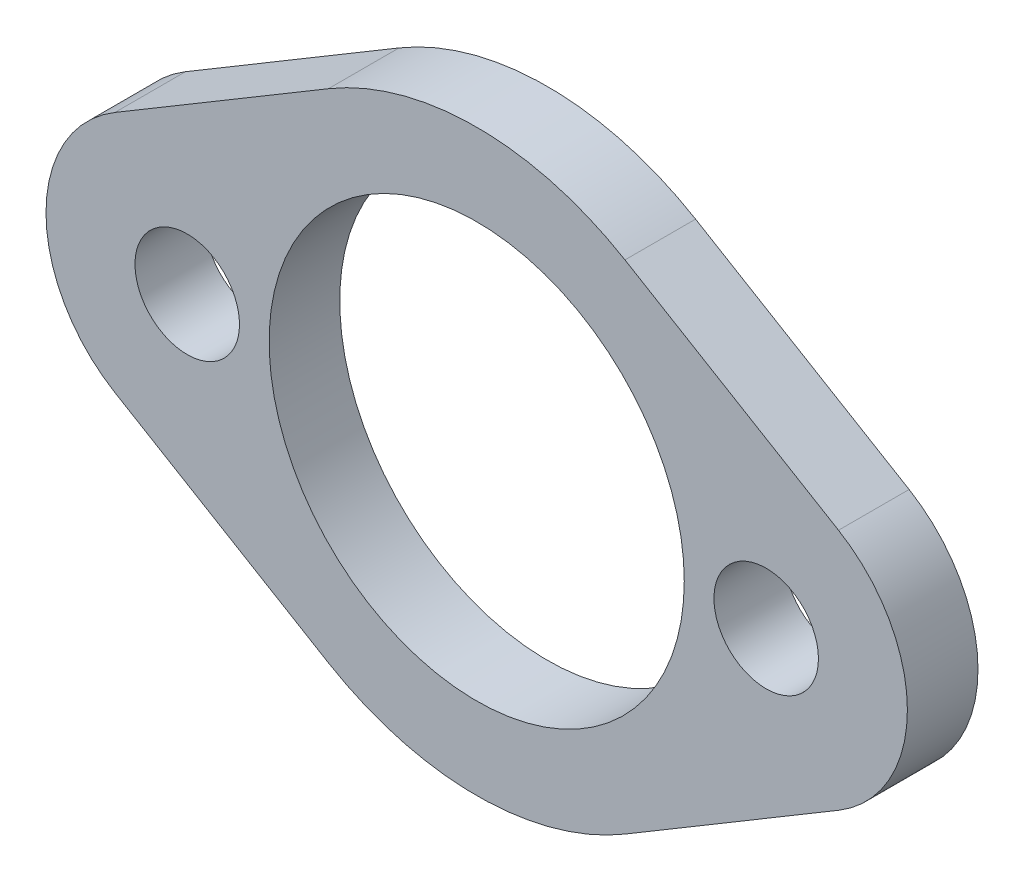
ISO-10303-21;
HEADER;
FILE_DESCRIPTION(('STEP AP214'),'2;1');
FILE_NAME('part.step','',(''),(''),'','','');
FILE_SCHEMA(('AUTOMOTIVE_DESIGN { 1 0 10303 214 1 1 1 1 }'));
ENDSEC;
DATA;
#1=APPLICATION_CONTEXT('core data for automotive mechanical design processes');
#2=APPLICATION_PROTOCOL_DEFINITION('international standard','automotive_design',2000,#1);
#3=PRODUCT_CONTEXT('',#1,'mechanical');
#4=PRODUCT('Part','Part','',(#3));
#5=PRODUCT_RELATED_PRODUCT_CATEGORY('part','',(#4));
#6=PRODUCT_DEFINITION_FORMATION('','',#4);
#7=PRODUCT_DEFINITION_CONTEXT('part definition',#1,'design');
#8=PRODUCT_DEFINITION('design','',#6,#7);
#9=PRODUCT_DEFINITION_SHAPE('','',#8);
#10=(LENGTH_UNIT() NAMED_UNIT(*) SI_UNIT(.MILLI.,.METRE.));
#11=(NAMED_UNIT(*) PLANE_ANGLE_UNIT() SI_UNIT($,.RADIAN.));
#12=(NAMED_UNIT(*) SI_UNIT($,.STERADIAN.) SOLID_ANGLE_UNIT());
#13=UNCERTAINTY_MEASURE_WITH_UNIT(LENGTH_MEASURE(1.E-05),#10,'distance_accuracy_value','');
#14=(GEOMETRIC_REPRESENTATION_CONTEXT(3) GLOBAL_UNCERTAINTY_ASSIGNED_CONTEXT((#13)) GLOBAL_UNIT_ASSIGNED_CONTEXT((#10,
#11,#12)) REPRESENTATION_CONTEXT('',''));
#15=CARTESIAN_POINT('',(0.,0.,0.));
#16=DIRECTION('',(0.,0.,1.));
#17=DIRECTION('',(1.,0.,0.));
#18=AXIS2_PLACEMENT_3D('',#15,#16,#17);
#19=CARTESIAN_POINT('',(0.,0.,6.35));
#20=DIRECTION('',(0.,0.,1.));
#21=DIRECTION('',(1.,0.,0.));
#22=AXIS2_PLACEMENT_3D('',#19,#20,#21);
#23=PLANE('',#22);
#24=CARTESIAN_POINT('',(26.035,0.,6.35));
#25=DIRECTION('',(0.,0.,1.));
#26=DIRECTION('',(1.,0.,0.));
#27=AXIS2_PLACEMENT_3D('',#24,#25,#26);
#28=CIRCLE('',#27,4.699);
#29=CARTESIAN_POINT('',(30.734,0.,6.35));
#30=VERTEX_POINT('',#29);
#31=EDGE_CURVE('E181',#30,#30,#28,.T.);
#32=ORIENTED_EDGE('',*,*,#31,.F.);
#33=EDGE_LOOP('',(#32));
#34=FACE_BOUND('',#33,.T.);
#35=CARTESIAN_POINT('',(0.,0.,6.35));
#36=DIRECTION('',(0.,0.,1.));
#37=DIRECTION('',(1.,0.,0.));
#38=AXIS2_PLACEMENT_3D('',#35,#36,#37);
#39=CIRCLE('',#38,26.035);
#40=CARTESIAN_POINT('',(13.335,22.3606574143069,6.35));
#41=VERTEX_POINT('',#40);
#42=CARTESIAN_POINT('',(-13.335,22.3606574143069,6.35));
#43=VERTEX_POINT('',#42);
#44=EDGE_CURVE('E144',#41,#43,#39,.T.);
#45=ORIENTED_EDGE('',*,*,#44,.T.);
#46=DIRECTION('',(-0.858869115202879,-0.512195121951219,0.));
#47=VECTOR('',#46,1.);
#48=CARTESIAN_POINT('',(-13.335,22.3606574143069,6.35));
#49=LINE('',#48,#47);
#50=CARTESIAN_POINT('',(-32.5398780487805,10.9076377630766,6.35));
#51=VERTEX_POINT('',#50);
#52=EDGE_CURVE('E92',#43,#51,#49,.T.);
#53=ORIENTED_EDGE('',*,*,#52,.T.);
#54=CARTESIAN_POINT('',(-26.035,0.,6.35));
#55=DIRECTION('',(0.,0.,1.));
#56=DIRECTION('',(-1.,0.,0.));
#57=AXIS2_PLACEMENT_3D('',#54,#55,#56);
#58=CIRCLE('',#57,12.7);
#59=CARTESIAN_POINT('',(-32.5398780487805,-10.9076377630766,6.35));
#60=VERTEX_POINT('',#59);
#61=EDGE_CURVE('E159',#51,#60,#58,.T.);
#62=ORIENTED_EDGE('',*,*,#61,.T.);
#63=DIRECTION('',(0.858869115202879,-0.512195121951219,0.));
#64=VECTOR('',#63,1.);
#65=CARTESIAN_POINT('',(-13.335,-22.3606574143069,6.35));
#66=LINE('',#65,#64);
#67=CARTESIAN_POINT('',(-13.335,-22.3606574143069,6.35));
#68=VERTEX_POINT('',#67);
#69=EDGE_CURVE('E172',#60,#68,#66,.T.);
#70=ORIENTED_EDGE('',*,*,#69,.T.);
#71=CARTESIAN_POINT('',(0.,0.,6.35));
#72=DIRECTION('',(0.,0.,1.));
#73=DIRECTION('',(1.,0.,0.));
#74=AXIS2_PLACEMENT_3D('',#71,#72,#73);
#75=CIRCLE('',#74,26.035);
#76=CARTESIAN_POINT('',(13.335,-22.3606574143069,6.35));
#77=VERTEX_POINT('',#76);
#78=EDGE_CURVE('E111',#68,#77,#75,.T.);
#79=ORIENTED_EDGE('',*,*,#78,.T.);
#80=DIRECTION('',(0.858869115202879,0.512195121951219,0.));
#81=VECTOR('',#80,1.);
#82=CARTESIAN_POINT('',(13.335,-22.3606574143069,6.35));
#83=LINE('',#82,#81);
#84=CARTESIAN_POINT('',(32.5398780487805,-10.9076377630766,6.35));
#85=VERTEX_POINT('',#84);
#86=EDGE_CURVE('E105',#77,#85,#83,.T.);
#87=ORIENTED_EDGE('',*,*,#86,.T.);
#88=CARTESIAN_POINT('',(26.035,0.,6.35));
#89=DIRECTION('',(0.,0.,1.));
#90=DIRECTION('',(1.,0.,0.));
#91=AXIS2_PLACEMENT_3D('',#88,#89,#90);
#92=CIRCLE('',#91,12.7);
#93=CARTESIAN_POINT('',(32.5398780487805,10.9076377630766,6.35));
#94=VERTEX_POINT('',#93);
#95=EDGE_CURVE('E109',#85,#94,#92,.T.);
#96=ORIENTED_EDGE('',*,*,#95,.T.);
#97=DIRECTION('',(-0.858869115202879,0.512195121951219,0.));
#98=VECTOR('',#97,1.);
#99=CARTESIAN_POINT('',(13.335,22.3606574143069,6.35));
#100=LINE('',#99,#98);
#101=EDGE_CURVE('E49',#94,#41,#100,.T.);
#102=ORIENTED_EDGE('',*,*,#101,.T.);
#103=EDGE_LOOP('',(#45,#53,#62,#70,#79,#87,#96,#102));
#104=FACE_BOUND('',#103,.T.);
#105=CARTESIAN_POINT('',(0.,0.,6.35));
#106=DIRECTION('',(0.,0.,1.));
#107=DIRECTION('',(1.,0.,0.));
#108=AXIS2_PLACEMENT_3D('',#105,#106,#107);
#109=CIRCLE('',#108,18.669);
#110=CARTESIAN_POINT('',(18.669,0.,6.35));
#111=VERTEX_POINT('',#110);
#112=EDGE_CURVE('E133',#111,#111,#109,.T.);
#113=ORIENTED_EDGE('',*,*,#112,.F.);
#114=EDGE_LOOP('',(#113));
#115=FACE_BOUND('',#114,.T.);
#116=CARTESIAN_POINT('',(-26.035,0.,6.35));
#117=DIRECTION('',(0.,0.,1.));
#118=DIRECTION('',(-1.,0.,0.));
#119=AXIS2_PLACEMENT_3D('',#116,#117,#118);
#120=CIRCLE('',#119,4.699);
#121=CARTESIAN_POINT('',(-30.734,0.,6.35));
#122=VERTEX_POINT('',#121);
#123=EDGE_CURVE('E187',#122,#122,#120,.T.);
#124=ORIENTED_EDGE('',*,*,#123,.F.);
#125=EDGE_LOOP('',(#124));
#126=FACE_BOUND('',#125,.T.);
#127=ADVANCED_FACE('F32',(#34,#104,#115,#126),#23,.T.);
#128=CARTESIAN_POINT('',(0.,0.,0.));
#129=DIRECTION('',(0.,0.,1.));
#130=DIRECTION('',(1.,0.,0.));
#131=AXIS2_PLACEMENT_3D('',#128,#129,#130);
#132=PLANE('',#131);
#133=CARTESIAN_POINT('',(26.035,0.,0.));
#134=DIRECTION('',(0.,0.,1.));
#135=DIRECTION('',(1.,0.,0.));
#136=AXIS2_PLACEMENT_3D('',#133,#134,#135);
#137=CIRCLE('',#136,4.699);
#138=CARTESIAN_POINT('',(30.734,0.,0.));
#139=VERTEX_POINT('',#138);
#140=EDGE_CURVE('E184',#139,#139,#137,.T.);
#141=ORIENTED_EDGE('',*,*,#140,.T.);
#142=EDGE_LOOP('',(#141));
#143=FACE_BOUND('',#142,.T.);
#144=CARTESIAN_POINT('',(0.,0.,0.));
#145=DIRECTION('',(0.,0.,1.));
#146=DIRECTION('',(1.,0.,0.));
#147=AXIS2_PLACEMENT_3D('',#144,#145,#146);
#148=CIRCLE('',#147,26.035);
#149=CARTESIAN_POINT('',(13.335,22.3606574143069,0.));
#150=VERTEX_POINT('',#149);
#151=CARTESIAN_POINT('',(-13.335,22.3606574143069,0.));
#152=VERTEX_POINT('',#151);
#153=EDGE_CURVE('E129',#150,#152,#148,.T.);
#154=ORIENTED_EDGE('',*,*,#153,.F.);
#155=DIRECTION('',(-0.858869115202879,0.512195121951219,0.));
#156=VECTOR('',#155,1.);
#157=CARTESIAN_POINT('',(13.335,22.3606574143069,0.));
#158=LINE('',#157,#156);
#159=CARTESIAN_POINT('',(32.5398780487805,10.9076377630766,0.));
#160=VERTEX_POINT('',#159);
#161=EDGE_CURVE('E84',#160,#150,#158,.T.);
#162=ORIENTED_EDGE('',*,*,#161,.F.);
#163=CARTESIAN_POINT('',(26.035,0.,0.));
#164=DIRECTION('',(0.,0.,1.));
#165=DIRECTION('',(1.,0.,0.));
#166=AXIS2_PLACEMENT_3D('',#163,#164,#165);
#167=CIRCLE('',#166,12.7);
#168=CARTESIAN_POINT('',(32.5398780487805,-10.9076377630766,0.));
#169=VERTEX_POINT('',#168);
#170=EDGE_CURVE('E78',#169,#160,#167,.T.);
#171=ORIENTED_EDGE('',*,*,#170,.F.);
#172=DIRECTION('',(0.858869115202879,0.512195121951219,0.));
#173=VECTOR('',#172,1.);
#174=CARTESIAN_POINT('',(13.335,-22.3606574143069,0.));
#175=LINE('',#174,#173);
#176=CARTESIAN_POINT('',(13.335,-22.3606574143069,0.));
#177=VERTEX_POINT('',#176);
#178=EDGE_CURVE('E119',#177,#169,#175,.T.);
#179=ORIENTED_EDGE('',*,*,#178,.F.);
#180=CARTESIAN_POINT('',(0.,0.,0.));
#181=DIRECTION('',(0.,0.,1.));
#182=DIRECTION('',(1.,0.,0.));
#183=AXIS2_PLACEMENT_3D('',#180,#181,#182);
#184=CIRCLE('',#183,26.035);
#185=CARTESIAN_POINT('',(-13.335,-22.3606574143069,0.));
#186=VERTEX_POINT('',#185);
#187=EDGE_CURVE('E139',#186,#177,#184,.T.);
#188=ORIENTED_EDGE('',*,*,#187,.F.);
#189=DIRECTION('',(0.858869115202879,-0.512195121951219,0.));
#190=VECTOR('',#189,1.);
#191=CARTESIAN_POINT('',(-13.335,-22.3606574143069,0.));
#192=LINE('',#191,#190);
#193=CARTESIAN_POINT('',(-32.5398780487805,-10.9076377630766,0.));
#194=VERTEX_POINT('',#193);
#195=EDGE_CURVE('E137',#194,#186,#192,.T.);
#196=ORIENTED_EDGE('',*,*,#195,.F.);
#197=CARTESIAN_POINT('',(-26.035,0.,0.));
#198=DIRECTION('',(0.,0.,1.));
#199=DIRECTION('',(-1.,0.,0.));
#200=AXIS2_PLACEMENT_3D('',#197,#198,#199);
#201=CIRCLE('',#200,12.7);
#202=CARTESIAN_POINT('',(-32.5398780487805,10.9076377630766,0.));
#203=VERTEX_POINT('',#202);
#204=EDGE_CURVE('E135',#203,#194,#201,.T.);
#205=ORIENTED_EDGE('',*,*,#204,.F.);
#206=DIRECTION('',(-0.858869115202879,-0.512195121951219,0.));
#207=VECTOR('',#206,1.);
#208=CARTESIAN_POINT('',(-13.335,22.3606574143069,0.));
#209=LINE('',#208,#207);
#210=EDGE_CURVE('E132',#152,#203,#209,.T.);
#211=ORIENTED_EDGE('',*,*,#210,.F.);
#212=EDGE_LOOP('',(#154,#162,#171,#179,#188,#196,#205,#211));
#213=FACE_BOUND('',#212,.T.);
#214=CARTESIAN_POINT('',(0.,0.,0.));
#215=DIRECTION('',(0.,0.,1.));
#216=DIRECTION('',(1.,0.,0.));
#217=AXIS2_PLACEMENT_3D('',#214,#215,#216);
#218=CIRCLE('',#217,18.669);
#219=CARTESIAN_POINT('',(18.669,0.,0.));
#220=VERTEX_POINT('',#219);
#221=EDGE_CURVE('E178',#220,#220,#218,.T.);
#222=ORIENTED_EDGE('',*,*,#221,.T.);
#223=EDGE_LOOP('',(#222));
#224=FACE_BOUND('',#223,.T.);
#225=CARTESIAN_POINT('',(-26.035,0.,0.));
#226=DIRECTION('',(0.,0.,1.));
#227=DIRECTION('',(-1.,0.,0.));
#228=AXIS2_PLACEMENT_3D('',#225,#226,#227);
#229=CIRCLE('',#228,4.699);
#230=CARTESIAN_POINT('',(-30.734,0.,0.));
#231=VERTEX_POINT('',#230);
#232=EDGE_CURVE('E190',#231,#231,#229,.T.);
#233=ORIENTED_EDGE('',*,*,#232,.T.);
#234=EDGE_LOOP('',(#233));
#235=FACE_BOUND('',#234,.T.);
#236=ADVANCED_FACE('F163',(#143,#213,#224,#235),#132,.F.);
#237=CARTESIAN_POINT('',(0.,0.,6.35));
#238=DIRECTION('',(0.,0.,-1.));
#239=DIRECTION('',(-1.,0.,0.));
#240=AXIS2_PLACEMENT_3D('',#237,#238,#239);
#241=CYLINDRICAL_SURFACE('',#240,26.035);
#242=ORIENTED_EDGE('',*,*,#153,.T.);
#243=DIRECTION('',(0.,0.,-1.));
#244=VECTOR('',#243,1.);
#245=CARTESIAN_POINT('',(-13.335,22.3606574143069,6.35));
#246=LINE('',#245,#244);
#247=EDGE_CURVE('E11',#43,#152,#246,.T.);
#248=ORIENTED_EDGE('',*,*,#247,.F.);
#249=ORIENTED_EDGE('',*,*,#44,.F.);
#250=DIRECTION('',(0.,0.,-1.));
#251=VECTOR('',#250,1.);
#252=CARTESIAN_POINT('',(13.335,22.3606574143069,6.35));
#253=LINE('',#252,#251);
#254=EDGE_CURVE('E125',#41,#150,#253,.T.);
#255=ORIENTED_EDGE('',*,*,#254,.T.);
#256=EDGE_LOOP('',(#242,#248,#249,#255));
#257=FACE_BOUND('',#256,.T.);
#258=ADVANCED_FACE('F34',(#257),#241,.T.);
#259=CARTESIAN_POINT('',(-13.335,22.3606574143069,6.35));
#260=DIRECTION('',(0.512195121951219,-0.858869115202879,0.));
#261=DIRECTION('',(0.858869115202879,0.512195121951219,0.));
#262=AXIS2_PLACEMENT_3D('',#259,#260,#261);
#263=PLANE('',#262);
#264=ORIENTED_EDGE('',*,*,#210,.T.);
#265=DIRECTION('',(0.,0.,-1.));
#266=VECTOR('',#265,1.);
#267=CARTESIAN_POINT('',(-32.5398780487805,10.9076377630766,6.35));
#268=LINE('',#267,#266);
#269=EDGE_CURVE('E41',#51,#203,#268,.T.);
#270=ORIENTED_EDGE('',*,*,#269,.F.);
#271=ORIENTED_EDGE('',*,*,#52,.F.);
#272=ORIENTED_EDGE('',*,*,#247,.T.);
#273=EDGE_LOOP('',(#264,#270,#271,#272));
#274=FACE_BOUND('',#273,.T.);
#275=ADVANCED_FACE('F224',(#274),#263,.F.);
#276=CARTESIAN_POINT('',(-26.035,0.,6.35));
#277=DIRECTION('',(0.,0.,-1.));
#278=DIRECTION('',(-1.,0.,0.));
#279=AXIS2_PLACEMENT_3D('',#276,#277,#278);
#280=CYLINDRICAL_SURFACE('',#279,12.7);
#281=ORIENTED_EDGE('',*,*,#204,.T.);
#282=DIRECTION('',(0.,0.,-1.));
#283=VECTOR('',#282,1.);
#284=CARTESIAN_POINT('',(-32.5398780487805,-10.9076377630766,6.35));
#285=LINE('',#284,#283);
#286=EDGE_CURVE('E151',#60,#194,#285,.T.);
#287=ORIENTED_EDGE('',*,*,#286,.F.);
#288=ORIENTED_EDGE('',*,*,#61,.F.);
#289=ORIENTED_EDGE('',*,*,#269,.T.);
#290=EDGE_LOOP('',(#281,#287,#288,#289));
#291=FACE_BOUND('',#290,.T.);
#292=ADVANCED_FACE('F157',(#291),#280,.T.);
#293=CARTESIAN_POINT('',(-13.335,-22.3606574143069,6.35));
#294=DIRECTION('',(0.512195121951219,0.858869115202879,0.));
#295=DIRECTION('',(-0.858869115202879,0.512195121951219,0.));
#296=AXIS2_PLACEMENT_3D('',#293,#294,#295);
#297=PLANE('',#296);
#298=ORIENTED_EDGE('',*,*,#195,.T.);
#299=DIRECTION('',(0.,0.,-1.));
#300=VECTOR('',#299,1.);
#301=CARTESIAN_POINT('',(-13.335,-22.3606574143069,6.35));
#302=LINE('',#301,#300);
#303=EDGE_CURVE('E148',#68,#186,#302,.T.);
#304=ORIENTED_EDGE('',*,*,#303,.F.);
#305=ORIENTED_EDGE('',*,*,#69,.F.);
#306=ORIENTED_EDGE('',*,*,#286,.T.);
#307=EDGE_LOOP('',(#298,#304,#305,#306));
#308=FACE_BOUND('',#307,.T.);
#309=ADVANCED_FACE('F168',(#308),#297,.F.);
#310=CARTESIAN_POINT('',(0.,0.,6.35));
#311=DIRECTION('',(0.,0.,-1.));
#312=DIRECTION('',(-1.,0.,0.));
#313=AXIS2_PLACEMENT_3D('',#310,#311,#312);
#314=CYLINDRICAL_SURFACE('',#313,26.035);
#315=ORIENTED_EDGE('',*,*,#187,.T.);
#316=DIRECTION('',(0.,0.,-1.));
#317=VECTOR('',#316,1.);
#318=CARTESIAN_POINT('',(13.335,-22.3606574143069,6.35));
#319=LINE('',#318,#317);
#320=EDGE_CURVE('E120',#77,#177,#319,.T.);
#321=ORIENTED_EDGE('',*,*,#320,.F.);
#322=ORIENTED_EDGE('',*,*,#78,.F.);
#323=ORIENTED_EDGE('',*,*,#303,.T.);
#324=EDGE_LOOP('',(#315,#321,#322,#323));
#325=FACE_BOUND('',#324,.T.);
#326=ADVANCED_FACE('F171',(#325),#314,.T.);
#327=CARTESIAN_POINT('',(13.335,-22.3606574143069,6.35));
#328=DIRECTION('',(-0.512195121951219,0.858869115202879,0.));
#329=DIRECTION('',(-0.858869115202879,-0.512195121951219,0.));
#330=AXIS2_PLACEMENT_3D('',#327,#328,#329);
#331=PLANE('',#330);
#332=ORIENTED_EDGE('',*,*,#178,.T.);
#333=DIRECTION('',(0.,0.,-1.));
#334=VECTOR('',#333,1.);
#335=CARTESIAN_POINT('',(32.5398780487805,-10.9076377630766,6.35));
#336=LINE('',#335,#334);
#337=EDGE_CURVE('E116',#85,#169,#336,.T.);
#338=ORIENTED_EDGE('',*,*,#337,.F.);
#339=ORIENTED_EDGE('',*,*,#86,.F.);
#340=ORIENTED_EDGE('',*,*,#320,.T.);
#341=EDGE_LOOP('',(#332,#338,#339,#340));
#342=FACE_BOUND('',#341,.T.);
#343=ADVANCED_FACE('F117',(#342),#331,.F.);
#344=CARTESIAN_POINT('',(26.035,0.,6.35));
#345=DIRECTION('',(0.,0.,-1.));
#346=DIRECTION('',(-1.,0.,0.));
#347=AXIS2_PLACEMENT_3D('',#344,#345,#346);
#348=CYLINDRICAL_SURFACE('',#347,12.7);
#349=ORIENTED_EDGE('',*,*,#170,.T.);
#350=DIRECTION('',(0.,0.,-1.));
#351=VECTOR('',#350,1.);
#352=CARTESIAN_POINT('',(32.5398780487805,10.9076377630766,6.35));
#353=LINE('',#352,#351);
#354=EDGE_CURVE('E121',#94,#160,#353,.T.);
#355=ORIENTED_EDGE('',*,*,#354,.F.);
#356=ORIENTED_EDGE('',*,*,#95,.F.);
#357=ORIENTED_EDGE('',*,*,#337,.T.);
#358=EDGE_LOOP('',(#349,#355,#356,#357));
#359=FACE_BOUND('',#358,.T.);
#360=ADVANCED_FACE('F123',(#359),#348,.T.);
#361=CARTESIAN_POINT('',(13.335,22.3606574143069,6.35));
#362=DIRECTION('',(-0.512195121951219,-0.858869115202879,0.));
#363=DIRECTION('',(0.858869115202879,-0.512195121951219,0.));
#364=AXIS2_PLACEMENT_3D('',#361,#362,#363);
#365=PLANE('',#364);
#366=ORIENTED_EDGE('',*,*,#161,.T.);
#367=ORIENTED_EDGE('',*,*,#254,.F.);
#368=ORIENTED_EDGE('',*,*,#101,.F.);
#369=ORIENTED_EDGE('',*,*,#354,.T.);
#370=EDGE_LOOP('',(#366,#367,#368,#369));
#371=FACE_BOUND('',#370,.T.);
#372=ADVANCED_FACE('F212',(#371),#365,.F.);
#373=CARTESIAN_POINT('',(0.,0.,6.35));
#374=DIRECTION('',(0.,0.,-1.));
#375=DIRECTION('',(-1.,0.,0.));
#376=AXIS2_PLACEMENT_3D('',#373,#374,#375);
#377=CYLINDRICAL_SURFACE('',#376,18.669);
#378=ORIENTED_EDGE('',*,*,#112,.T.);
#379=EDGE_LOOP('',(#378));
#380=FACE_BOUND('',#379,.T.);
#381=ORIENTED_EDGE('',*,*,#221,.F.);
#382=EDGE_LOOP('',(#381));
#383=FACE_BOUND('',#382,.T.);
#384=ADVANCED_FACE('F209',(#380,#383),#377,.F.);
#385=CARTESIAN_POINT('',(26.035,0.,6.35));
#386=DIRECTION('',(0.,0.,-1.));
#387=DIRECTION('',(-1.,0.,0.));
#388=AXIS2_PLACEMENT_3D('',#385,#386,#387);
#389=CYLINDRICAL_SURFACE('',#388,4.699);
#390=ORIENTED_EDGE('',*,*,#31,.T.);
#391=EDGE_LOOP('',(#390));
#392=FACE_BOUND('',#391,.T.);
#393=ORIENTED_EDGE('',*,*,#140,.F.);
#394=EDGE_LOOP('',(#393));
#395=FACE_BOUND('',#394,.T.);
#396=ADVANCED_FACE('F288',(#392,#395),#389,.F.);
#397=CARTESIAN_POINT('',(-26.035,0.,6.35));
#398=DIRECTION('',(0.,0.,-1.));
#399=DIRECTION('',(-1.,0.,0.));
#400=AXIS2_PLACEMENT_3D('',#397,#398,#399);
#401=CYLINDRICAL_SURFACE('',#400,4.699);
#402=ORIENTED_EDGE('',*,*,#123,.T.);
#403=EDGE_LOOP('',(#402));
#404=FACE_BOUND('',#403,.T.);
#405=ORIENTED_EDGE('',*,*,#232,.F.);
#406=EDGE_LOOP('',(#405));
#407=FACE_BOUND('',#406,.T.);
#408=ADVANCED_FACE('F196',(#404,#407),#401,.F.);
#409=CLOSED_SHELL('',(#127,#236,#258,#275,#292,#309,#326,#343,#360,#372,#384,#396,#408));
#410=MANIFOLD_SOLID_BREP('B2',#409);
#411=ADVANCED_BREP_SHAPE_REPRESENTATION('',(#18,#410),#14);
#412=SHAPE_DEFINITION_REPRESENTATION(#9,#411);
ENDSEC;
END-ISO-10303-21;
